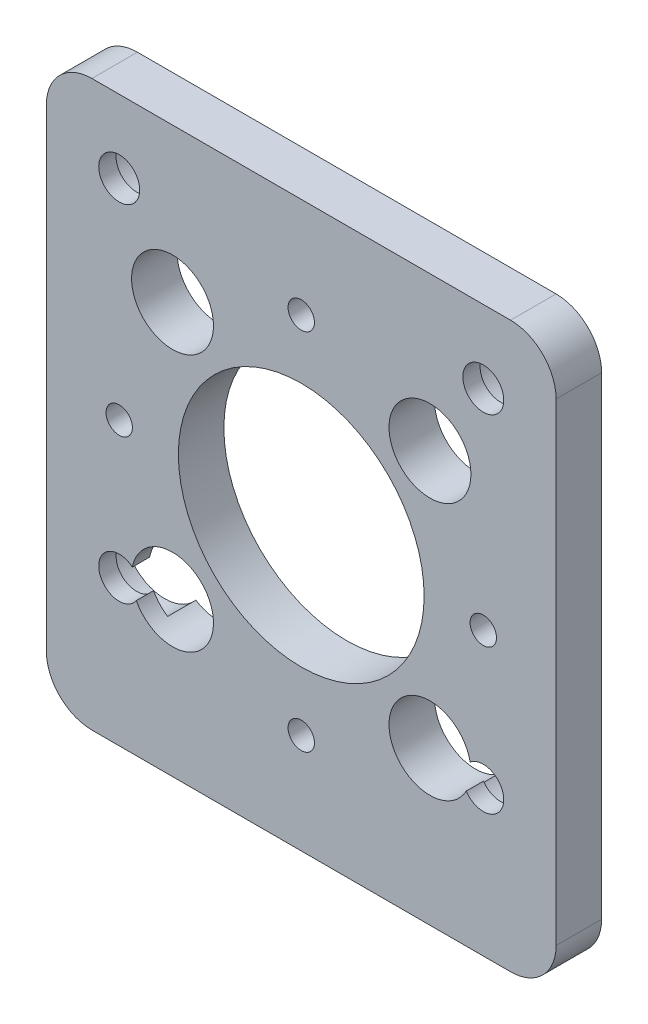
ISO-10303-21;
HEADER;
FILE_DESCRIPTION(('STEP AP214'),'2;1');
FILE_NAME('part.step','',(''),(''),'','','');
FILE_SCHEMA(('AUTOMOTIVE_DESIGN { 1 0 10303 214 1 1 1 1 }'));
ENDSEC;
DATA;
#1=APPLICATION_CONTEXT('core data for automotive mechanical design processes');
#2=APPLICATION_PROTOCOL_DEFINITION('international standard','automotive_design',2000,#1);
#3=PRODUCT_CONTEXT('',#1,'mechanical');
#4=PRODUCT('Part','Part','',(#3));
#5=PRODUCT_RELATED_PRODUCT_CATEGORY('part','',(#4));
#6=PRODUCT_DEFINITION_FORMATION('','',#4);
#7=PRODUCT_DEFINITION_CONTEXT('part definition',#1,'design');
#8=PRODUCT_DEFINITION('design','',#6,#7);
#9=PRODUCT_DEFINITION_SHAPE('','',#8);
#10=(LENGTH_UNIT() NAMED_UNIT(*) SI_UNIT(.MILLI.,.METRE.));
#11=(NAMED_UNIT(*) PLANE_ANGLE_UNIT() SI_UNIT($,.RADIAN.));
#12=(NAMED_UNIT(*) SI_UNIT($,.STERADIAN.) SOLID_ANGLE_UNIT());
#13=UNCERTAINTY_MEASURE_WITH_UNIT(LENGTH_MEASURE(1.E-05),#10,'distance_accuracy_value','');
#14=(GEOMETRIC_REPRESENTATION_CONTEXT(3) GLOBAL_UNCERTAINTY_ASSIGNED_CONTEXT((#13)) GLOBAL_UNIT_ASSIGNED_CONTEXT((#10,
#11,#12)) REPRESENTATION_CONTEXT('',''));
#15=CARTESIAN_POINT('',(0.,0.,0.));
#16=DIRECTION('',(0.,0.,1.));
#17=DIRECTION('',(1.,0.,0.));
#18=AXIS2_PLACEMENT_3D('',#15,#16,#17);
#19=CARTESIAN_POINT('',(0.,0.,5.));
#20=DIRECTION('',(0.,0.,-1.));
#21=DIRECTION('',(-1.,0.,0.));
#22=AXIS2_PLACEMENT_3D('',#19,#20,#21);
#23=PLANE('',#22);
#24=CARTESIAN_POINT('',(14.142135623731,14.1421356237309,5.));
#25=DIRECTION('',(0.,0.,1.));
#26=DIRECTION('',(1.,0.,0.));
#27=AXIS2_PLACEMENT_3D('',#24,#25,#26);
#28=CIRCLE('',#27,4.5);
#29=CARTESIAN_POINT('',(18.642135623731,14.1421356237309,5.));
#30=VERTEX_POINT('',#29);
#31=EDGE_CURVE('E439',#30,#30,#28,.T.);
#32=ORIENTED_EDGE('',*,*,#31,.F.);
#33=EDGE_LOOP('',(#32));
#34=FACE_BOUND('',#33,.T.);
#35=CARTESIAN_POINT('',(-14.1421356237309,14.142135623731,5.));
#36=DIRECTION('',(0.,0.,1.));
#37=DIRECTION('',(1.,0.,0.));
#38=AXIS2_PLACEMENT_3D('',#35,#36,#37);
#39=CIRCLE('',#38,4.5);
#40=CARTESIAN_POINT('',(-9.64213562373093,14.142135623731,5.));
#41=VERTEX_POINT('',#40);
#42=EDGE_CURVE('E169',#41,#41,#39,.T.);
#43=ORIENTED_EDGE('',*,*,#42,.F.);
#44=EDGE_LOOP('',(#43));
#45=FACE_BOUND('',#44,.T.);
#46=CARTESIAN_POINT('',(20.,23.,5.));
#47=DIRECTION('',(0.,0.,-1.));
#48=DIRECTION('',(-1.,0.,0.));
#49=AXIS2_PLACEMENT_3D('',#46,#47,#48);
#50=CIRCLE('',#49,2.25);
#51=CARTESIAN_POINT('',(17.75,23.,5.));
#52=VERTEX_POINT('',#51);
#53=EDGE_CURVE('E370',#52,#52,#50,.T.);
#54=ORIENTED_EDGE('',*,*,#53,.T.);
#55=EDGE_LOOP('',(#54));
#56=FACE_BOUND('',#55,.T.);
#57=CARTESIAN_POINT('',(-20.,23.,5.));
#58=DIRECTION('',(0.,0.,-1.));
#59=DIRECTION('',(-1.,0.,0.));
#60=AXIS2_PLACEMENT_3D('',#57,#58,#59);
#61=CIRCLE('',#60,2.25);
#62=CARTESIAN_POINT('',(-22.25,23.,5.));
#63=VERTEX_POINT('',#62);
#64=EDGE_CURVE('E386',#63,#63,#61,.T.);
#65=ORIENTED_EDGE('',*,*,#64,.T.);
#66=EDGE_LOOP('',(#65));
#67=FACE_BOUND('',#66,.T.);
#68=CARTESIAN_POINT('',(-20.,-15.,5.));
#69=DIRECTION('',(0.,0.,-1.));
#70=DIRECTION('',(-1.,0.,0.));
#71=AXIS2_PLACEMENT_3D('',#68,#69,#70);
#72=CIRCLE('',#71,2.25);
#73=CARTESIAN_POINT('',(-18.1229083262002,-16.2405752085833,5.));
#74=VERTEX_POINT('',#73);
#75=CARTESIAN_POINT('',(-18.5574592521436,-13.2732758787885,5.));
#76=VERTEX_POINT('',#75);
#77=EDGE_CURVE('E174',#74,#76,#72,.T.);
#78=ORIENTED_EDGE('',*,*,#77,.T.);
#79=CARTESIAN_POINT('',(-14.142135623731,-14.1421356237309,5.));
#80=DIRECTION('',(0.,0.,1.));
#81=DIRECTION('',(1.,0.,0.));
#82=AXIS2_PLACEMENT_3D('',#79,#80,#81);
#83=CIRCLE('',#82,4.5);
#84=EDGE_CURVE('E159',#74,#76,#83,.T.);
#85=ORIENTED_EDGE('',*,*,#84,.F.);
#86=EDGE_LOOP('',(#78,#85));
#87=FACE_BOUND('',#86,.T.);
#88=CARTESIAN_POINT('',(20.,-15.,5.));
#89=DIRECTION('',(0.,0.,-1.));
#90=DIRECTION('',(-1.,0.,0.));
#91=AXIS2_PLACEMENT_3D('',#88,#89,#90);
#92=CIRCLE('',#91,2.25);
#93=CARTESIAN_POINT('',(18.5574592521435,-13.2732758787885,5.));
#94=VERTEX_POINT('',#93);
#95=CARTESIAN_POINT('',(18.1229083262002,-16.2405752085833,5.));
#96=VERTEX_POINT('',#95);
#97=EDGE_CURVE('E200',#94,#96,#92,.T.);
#98=ORIENTED_EDGE('',*,*,#97,.T.);
#99=CARTESIAN_POINT('',(14.1421356237309,-14.142135623731,5.));
#100=DIRECTION('',(0.,0.,1.));
#101=DIRECTION('',(1.,0.,0.));
#102=AXIS2_PLACEMENT_3D('',#99,#100,#101);
#103=CIRCLE('',#102,4.5);
#104=EDGE_CURVE('E442',#94,#96,#103,.T.);
#105=ORIENTED_EDGE('',*,*,#104,.F.);
#106=EDGE_LOOP('',(#98,#105));
#107=FACE_BOUND('',#106,.T.);
#108=CARTESIAN_POINT('',(0.,20.,5.));
#109=DIRECTION('',(0.,0.,-1.));
#110=DIRECTION('',(-1.,0.,0.));
#111=AXIS2_PLACEMENT_3D('',#108,#109,#110);
#112=CIRCLE('',#111,1.45);
#113=CARTESIAN_POINT('',(-1.45,20.,5.));
#114=VERTEX_POINT('',#113);
#115=EDGE_CURVE('E208',#114,#114,#112,.T.);
#116=ORIENTED_EDGE('',*,*,#115,.T.);
#117=EDGE_LOOP('',(#116));
#118=FACE_BOUND('',#117,.T.);
#119=CARTESIAN_POINT('',(0.,-20.,5.));
#120=DIRECTION('',(0.,0.,-1.));
#121=DIRECTION('',(-1.,0.,0.));
#122=AXIS2_PLACEMENT_3D('',#119,#120,#121);
#123=CIRCLE('',#122,1.45);
#124=CARTESIAN_POINT('',(-1.45,-20.,5.));
#125=VERTEX_POINT('',#124);
#126=EDGE_CURVE('E216',#125,#125,#123,.T.);
#127=ORIENTED_EDGE('',*,*,#126,.T.);
#128=EDGE_LOOP('',(#127));
#129=FACE_BOUND('',#128,.T.);
#130=CARTESIAN_POINT('',(-20.,0.,5.));
#131=DIRECTION('',(0.,0.,-1.));
#132=DIRECTION('',(-1.,0.,0.));
#133=AXIS2_PLACEMENT_3D('',#130,#131,#132);
#134=CIRCLE('',#133,1.45);
#135=CARTESIAN_POINT('',(-21.45,0.,5.));
#136=VERTEX_POINT('',#135);
#137=EDGE_CURVE('E224',#136,#136,#134,.T.);
#138=ORIENTED_EDGE('',*,*,#137,.T.);
#139=EDGE_LOOP('',(#138));
#140=FACE_BOUND('',#139,.T.);
#141=CARTESIAN_POINT('',(20.,0.,5.));
#142=DIRECTION('',(0.,0.,-1.));
#143=DIRECTION('',(-1.,0.,0.));
#144=AXIS2_PLACEMENT_3D('',#141,#142,#143);
#145=CIRCLE('',#144,1.45);
#146=CARTESIAN_POINT('',(18.55,0.,5.));
#147=VERTEX_POINT('',#146);
#148=EDGE_CURVE('E232',#147,#147,#145,.T.);
#149=ORIENTED_EDGE('',*,*,#148,.T.);
#150=EDGE_LOOP('',(#149));
#151=FACE_BOUND('',#150,.T.);
#152=DIRECTION('',(1.,0.,0.));
#153=VECTOR('',#152,1.);
#154=CARTESIAN_POINT('',(-28.,-31.,5.));
#155=LINE('',#154,#153);
#156=CARTESIAN_POINT('',(-23.,-31.,5.));
#157=VERTEX_POINT('',#156);
#158=CARTESIAN_POINT('',(23.,-31.,5.));
#159=VERTEX_POINT('',#158);
#160=EDGE_CURVE('E258',#157,#159,#155,.T.);
#161=ORIENTED_EDGE('',*,*,#160,.T.);
#162=CARTESIAN_POINT('',(23.,-26.,5.));
#163=DIRECTION('',(0.,0.,-1.));
#164=DIRECTION('',(-1.,0.,0.));
#165=AXIS2_PLACEMENT_3D('',#162,#163,#164);
#166=CIRCLE('',#165,5.);
#167=CARTESIAN_POINT('',(28.,-26.,5.));
#168=VERTEX_POINT('',#167);
#169=EDGE_CURVE('E311',#159,#168,#166,.F.);
#170=ORIENTED_EDGE('',*,*,#169,.T.);
#171=DIRECTION('',(0.,1.,0.));
#172=VECTOR('',#171,1.);
#173=CARTESIAN_POINT('',(28.,-31.,5.));
#174=LINE('',#173,#172);
#175=CARTESIAN_POINT('',(28.,26.,5.));
#176=VERTEX_POINT('',#175);
#177=EDGE_CURVE('E245',#168,#176,#174,.T.);
#178=ORIENTED_EDGE('',*,*,#177,.T.);
#179=CARTESIAN_POINT('',(23.,26.,5.));
#180=DIRECTION('',(0.,0.,-1.));
#181=DIRECTION('',(-1.,0.,0.));
#182=AXIS2_PLACEMENT_3D('',#179,#180,#181);
#183=CIRCLE('',#182,5.);
#184=CARTESIAN_POINT('',(23.,31.,5.));
#185=VERTEX_POINT('',#184);
#186=EDGE_CURVE('E302',#176,#185,#183,.F.);
#187=ORIENTED_EDGE('',*,*,#186,.T.);
#188=DIRECTION('',(-1.,0.,0.));
#189=VECTOR('',#188,1.);
#190=CARTESIAN_POINT('',(-28.,31.,5.));
#191=LINE('',#190,#189);
#192=CARTESIAN_POINT('',(-23.,31.,5.));
#193=VERTEX_POINT('',#192);
#194=EDGE_CURVE('E249',#185,#193,#191,.T.);
#195=ORIENTED_EDGE('',*,*,#194,.T.);
#196=CARTESIAN_POINT('',(-23.,26.,5.));
#197=DIRECTION('',(0.,0.,-1.));
#198=DIRECTION('',(-1.,0.,0.));
#199=AXIS2_PLACEMENT_3D('',#196,#197,#198);
#200=CIRCLE('',#199,5.);
#201=CARTESIAN_POINT('',(-28.,26.,5.));
#202=VERTEX_POINT('',#201);
#203=EDGE_CURVE('E305',#193,#202,#200,.F.);
#204=ORIENTED_EDGE('',*,*,#203,.T.);
#205=DIRECTION('',(0.,-1.,0.));
#206=VECTOR('',#205,1.);
#207=CARTESIAN_POINT('',(-28.,-31.,5.));
#208=LINE('',#207,#206);
#209=CARTESIAN_POINT('',(-28.,-26.,5.));
#210=VERTEX_POINT('',#209);
#211=EDGE_CURVE('E254',#202,#210,#208,.T.);
#212=ORIENTED_EDGE('',*,*,#211,.T.);
#213=CARTESIAN_POINT('',(-23.,-26.,5.));
#214=DIRECTION('',(0.,0.,-1.));
#215=DIRECTION('',(-1.,0.,0.));
#216=AXIS2_PLACEMENT_3D('',#213,#214,#215);
#217=CIRCLE('',#216,5.);
#218=EDGE_CURVE('E308',#210,#157,#217,.F.);
#219=ORIENTED_EDGE('',*,*,#218,.T.);
#220=EDGE_LOOP('',(#161,#170,#178,#187,#195,#204,#212,#219));
#221=FACE_BOUND('',#220,.T.);
#222=CARTESIAN_POINT('',(0.,0.,5.));
#223=DIRECTION('',(0.,0.,1.));
#224=DIRECTION('',(1.,0.,0.));
#225=AXIS2_PLACEMENT_3D('',#222,#223,#224);
#226=CIRCLE('',#225,13.5);
#227=CARTESIAN_POINT('',(13.5,0.,5.));
#228=VERTEX_POINT('',#227);
#229=EDGE_CURVE('E237',#228,#228,#226,.T.);
#230=ORIENTED_EDGE('',*,*,#229,.F.);
#231=EDGE_LOOP('',(#230));
#232=FACE_BOUND('',#231,.T.);
#233=ADVANCED_FACE('F45',(#34,#45,#56,#67,#87,#107,#118,#129,#140,#151,#221,#232),#23,.F.);
#234=CARTESIAN_POINT('',(0.,0.,0.));
#235=DIRECTION('',(0.,0.,-1.));
#236=DIRECTION('',(-1.,0.,0.));
#237=AXIS2_PLACEMENT_3D('',#234,#235,#236);
#238=PLANE('',#237);
#239=CARTESIAN_POINT('',(14.1421356237309,-14.142135623731,0.));
#240=DIRECTION('',(0.,0.,-1.));
#241=DIRECTION('',(-1.,0.,0.));
#242=AXIS2_PLACEMENT_3D('',#239,#240,#241);
#243=CIRCLE('',#242,4.5);
#244=CARTESIAN_POINT('',(16.5799543316291,-17.9246004216401,0.));
#245=VERTEX_POINT('',#244);
#246=CARTESIAN_POINT('',(17.5621812921018,-11.2175352020909,0.));
#247=VERTEX_POINT('',#246);
#248=EDGE_CURVE('E354',#245,#247,#243,.T.);
#249=ORIENTED_EDGE('',*,*,#248,.F.);
#250=CARTESIAN_POINT('',(20.,-15.,0.));
#251=DIRECTION('',(0.,0.,-1.));
#252=DIRECTION('',(-1.,0.,0.));
#253=AXIS2_PLACEMENT_3D('',#250,#251,#252);
#254=CIRCLE('',#253,4.5);
#255=EDGE_CURVE('E182',#247,#245,#254,.T.);
#256=ORIENTED_EDGE('',*,*,#255,.F.);
#257=EDGE_LOOP('',(#249,#256));
#258=FACE_BOUND('',#257,.T.);
#259=CARTESIAN_POINT('',(14.142135623731,14.1421356237309,0.));
#260=DIRECTION('',(0.,0.,-1.));
#261=DIRECTION('',(-1.,0.,0.));
#262=AXIS2_PLACEMENT_3D('',#259,#260,#261);
#263=CIRCLE('',#262,4.5);
#264=CARTESIAN_POINT('',(9.64213562373097,14.1421356237309,0.));
#265=VERTEX_POINT('',#264);
#266=EDGE_CURVE('E49',#265,#265,#263,.T.);
#267=ORIENTED_EDGE('',*,*,#266,.F.);
#268=EDGE_LOOP('',(#267));
#269=FACE_BOUND('',#268,.T.);
#270=CARTESIAN_POINT('',(-14.1421356237309,14.142135623731,0.));
#271=DIRECTION('',(0.,0.,-1.));
#272=DIRECTION('',(-1.,0.,0.));
#273=AXIS2_PLACEMENT_3D('',#270,#271,#272);
#274=CIRCLE('',#273,4.5);
#275=CARTESIAN_POINT('',(-18.6421356237309,14.142135623731,0.));
#276=VERTEX_POINT('',#275);
#277=EDGE_CURVE('E336',#276,#276,#274,.T.);
#278=ORIENTED_EDGE('',*,*,#277,.F.);
#279=EDGE_LOOP('',(#278));
#280=FACE_BOUND('',#279,.T.);
#281=CARTESIAN_POINT('',(-14.142135623731,-14.1421356237309,0.));
#282=DIRECTION('',(0.,0.,-1.));
#283=DIRECTION('',(-1.,0.,0.));
#284=AXIS2_PLACEMENT_3D('',#281,#282,#283);
#285=CIRCLE('',#284,4.5);
#286=CARTESIAN_POINT('',(-17.5621812921019,-11.2175352020908,0.));
#287=VERTEX_POINT('',#286);
#288=CARTESIAN_POINT('',(-16.5799543316291,-17.9246004216401,0.));
#289=VERTEX_POINT('',#288);
#290=EDGE_CURVE('E178',#287,#289,#285,.T.);
#291=ORIENTED_EDGE('',*,*,#290,.F.);
#292=CARTESIAN_POINT('',(-20.,-15.,0.));
#293=DIRECTION('',(0.,0.,-1.));
#294=DIRECTION('',(-1.,0.,0.));
#295=AXIS2_PLACEMENT_3D('',#292,#293,#294);
#296=CIRCLE('',#295,4.5);
#297=EDGE_CURVE('E390',#289,#287,#296,.T.);
#298=ORIENTED_EDGE('',*,*,#297,.F.);
#299=EDGE_LOOP('',(#291,#298));
#300=FACE_BOUND('',#299,.T.);
#301=CARTESIAN_POINT('',(20.,23.,0.));
#302=DIRECTION('',(0.,0.,-1.));
#303=DIRECTION('',(-1.,0.,0.));
#304=AXIS2_PLACEMENT_3D('',#301,#302,#303);
#305=CIRCLE('',#304,4.5);
#306=CARTESIAN_POINT('',(15.5,23.,0.));
#307=VERTEX_POINT('',#306);
#308=EDGE_CURVE('E345',#307,#307,#305,.T.);
#309=ORIENTED_EDGE('',*,*,#308,.F.);
#310=EDGE_LOOP('',(#309));
#311=FACE_BOUND('',#310,.T.);
#312=CARTESIAN_POINT('',(-20.,23.,0.));
#313=DIRECTION('',(0.,0.,-1.));
#314=DIRECTION('',(-1.,0.,0.));
#315=AXIS2_PLACEMENT_3D('',#312,#313,#314);
#316=CIRCLE('',#315,4.5);
#317=CARTESIAN_POINT('',(-24.5,23.,0.));
#318=VERTEX_POINT('',#317);
#319=EDGE_CURVE('E374',#318,#318,#316,.T.);
#320=ORIENTED_EDGE('',*,*,#319,.F.);
#321=EDGE_LOOP('',(#320));
#322=FACE_BOUND('',#321,.T.);
#323=CARTESIAN_POINT('',(0.,20.,0.));
#324=DIRECTION('',(0.,0.,-1.));
#325=DIRECTION('',(-1.,0.,0.));
#326=AXIS2_PLACEMENT_3D('',#323,#324,#325);
#327=CIRCLE('',#326,1.44999999999999);
#328=CARTESIAN_POINT('',(-1.44999999999999,20.,0.));
#329=VERTEX_POINT('',#328);
#330=EDGE_CURVE('E204',#329,#329,#327,.T.);
#331=ORIENTED_EDGE('',*,*,#330,.F.);
#332=EDGE_LOOP('',(#331));
#333=FACE_BOUND('',#332,.T.);
#334=CARTESIAN_POINT('',(0.,-20.,0.));
#335=DIRECTION('',(0.,0.,-1.));
#336=DIRECTION('',(-1.,0.,0.));
#337=AXIS2_PLACEMENT_3D('',#334,#335,#336);
#338=CIRCLE('',#337,1.44999999999999);
#339=CARTESIAN_POINT('',(-1.44999999999999,-20.,0.));
#340=VERTEX_POINT('',#339);
#341=EDGE_CURVE('E212',#340,#340,#338,.T.);
#342=ORIENTED_EDGE('',*,*,#341,.F.);
#343=EDGE_LOOP('',(#342));
#344=FACE_BOUND('',#343,.T.);
#345=CARTESIAN_POINT('',(-20.,0.,0.));
#346=DIRECTION('',(0.,0.,-1.));
#347=DIRECTION('',(-1.,0.,0.));
#348=AXIS2_PLACEMENT_3D('',#345,#346,#347);
#349=CIRCLE('',#348,1.44999999999999);
#350=CARTESIAN_POINT('',(-21.45,0.,0.));
#351=VERTEX_POINT('',#350);
#352=EDGE_CURVE('E220',#351,#351,#349,.T.);
#353=ORIENTED_EDGE('',*,*,#352,.F.);
#354=EDGE_LOOP('',(#353));
#355=FACE_BOUND('',#354,.T.);
#356=CARTESIAN_POINT('',(20.,0.,0.));
#357=DIRECTION('',(0.,0.,-1.));
#358=DIRECTION('',(-1.,0.,0.));
#359=AXIS2_PLACEMENT_3D('',#356,#357,#358);
#360=CIRCLE('',#359,1.44999999999999);
#361=CARTESIAN_POINT('',(18.55,0.,0.));
#362=VERTEX_POINT('',#361);
#363=EDGE_CURVE('E228',#362,#362,#360,.T.);
#364=ORIENTED_EDGE('',*,*,#363,.F.);
#365=EDGE_LOOP('',(#364));
#366=FACE_BOUND('',#365,.T.);
#367=DIRECTION('',(0.,1.,0.));
#368=VECTOR('',#367,1.);
#369=CARTESIAN_POINT('',(28.,-31.,0.));
#370=LINE('',#369,#368);
#371=CARTESIAN_POINT('',(28.,-26.,0.));
#372=VERTEX_POINT('',#371);
#373=CARTESIAN_POINT('',(28.,26.,0.));
#374=VERTEX_POINT('',#373);
#375=EDGE_CURVE('E241',#372,#374,#370,.T.);
#376=ORIENTED_EDGE('',*,*,#375,.F.);
#377=CARTESIAN_POINT('',(23.,-26.,0.));
#378=DIRECTION('',(0.,0.,-1.));
#379=DIRECTION('',(-1.,0.,0.));
#380=AXIS2_PLACEMENT_3D('',#377,#378,#379);
#381=CIRCLE('',#380,5.);
#382=CARTESIAN_POINT('',(23.,-31.,0.));
#383=VERTEX_POINT('',#382);
#384=EDGE_CURVE('E292',#372,#383,#381,.T.);
#385=ORIENTED_EDGE('',*,*,#384,.T.);
#386=DIRECTION('',(1.,0.,0.));
#387=VECTOR('',#386,1.);
#388=CARTESIAN_POINT('',(-28.,-31.,0.));
#389=LINE('',#388,#387);
#390=CARTESIAN_POINT('',(-23.,-31.,0.));
#391=VERTEX_POINT('',#390);
#392=EDGE_CURVE('E250',#391,#383,#389,.T.);
#393=ORIENTED_EDGE('',*,*,#392,.F.);
#394=CARTESIAN_POINT('',(-23.,-26.,0.));
#395=DIRECTION('',(0.,0.,-1.));
#396=DIRECTION('',(-1.,0.,0.));
#397=AXIS2_PLACEMENT_3D('',#394,#395,#396);
#398=CIRCLE('',#397,5.);
#399=CARTESIAN_POINT('',(-28.,-26.,0.));
#400=VERTEX_POINT('',#399);
#401=EDGE_CURVE('E289',#391,#400,#398,.T.);
#402=ORIENTED_EDGE('',*,*,#401,.T.);
#403=DIRECTION('',(0.,-1.,0.));
#404=VECTOR('',#403,1.);
#405=CARTESIAN_POINT('',(-28.,-31.,0.));
#406=LINE('',#405,#404);
#407=CARTESIAN_POINT('',(-28.,26.,0.));
#408=VERTEX_POINT('',#407);
#409=EDGE_CURVE('E270',#408,#400,#406,.T.);
#410=ORIENTED_EDGE('',*,*,#409,.F.);
#411=CARTESIAN_POINT('',(-23.,26.,0.));
#412=DIRECTION('',(0.,0.,-1.));
#413=DIRECTION('',(-1.,0.,0.));
#414=AXIS2_PLACEMENT_3D('',#411,#412,#413);
#415=CIRCLE('',#414,5.);
#416=CARTESIAN_POINT('',(-23.,31.,0.));
#417=VERTEX_POINT('',#416);
#418=EDGE_CURVE('E286',#408,#417,#415,.T.);
#419=ORIENTED_EDGE('',*,*,#418,.T.);
#420=DIRECTION('',(-1.,0.,0.));
#421=VECTOR('',#420,1.);
#422=CARTESIAN_POINT('',(-28.,31.,0.));
#423=LINE('',#422,#421);
#424=CARTESIAN_POINT('',(23.,31.,0.));
#425=VERTEX_POINT('',#424);
#426=EDGE_CURVE('E266',#425,#417,#423,.T.);
#427=ORIENTED_EDGE('',*,*,#426,.F.);
#428=CARTESIAN_POINT('',(23.,26.,0.));
#429=DIRECTION('',(0.,0.,-1.));
#430=DIRECTION('',(-1.,0.,0.));
#431=AXIS2_PLACEMENT_3D('',#428,#429,#430);
#432=CIRCLE('',#431,5.);
#433=EDGE_CURVE('E283',#425,#374,#432,.T.);
#434=ORIENTED_EDGE('',*,*,#433,.T.);
#435=EDGE_LOOP('',(#376,#385,#393,#402,#410,#419,#427,#434));
#436=FACE_BOUND('',#435,.T.);
#437=CARTESIAN_POINT('',(0.,0.,0.));
#438=DIRECTION('',(0.,0.,1.));
#439=DIRECTION('',(1.,0.,0.));
#440=AXIS2_PLACEMENT_3D('',#437,#438,#439);
#441=CIRCLE('',#440,13.5);
#442=CARTESIAN_POINT('',(13.5,0.,0.));
#443=VERTEX_POINT('',#442);
#444=EDGE_CURVE('E236',#443,#443,#441,.T.);
#445=ORIENTED_EDGE('',*,*,#444,.T.);
#446=EDGE_LOOP('',(#445));
#447=FACE_BOUND('',#446,.T.);
#448=ADVANCED_FACE('F405',(#258,#269,#280,#300,#311,#322,#333,#344,#355,#366,#436,#447),#238,.T.);
#449=CARTESIAN_POINT('',(28.,-31.,5.));
#450=DIRECTION('',(-1.,0.,0.));
#451=DIRECTION('',(0.,0.,1.));
#452=AXIS2_PLACEMENT_3D('',#449,#450,#451);
#453=PLANE('',#452);
#454=ORIENTED_EDGE('',*,*,#177,.F.);
#455=DIRECTION('',(0.,0.,-1.));
#456=VECTOR('',#455,1.);
#457=CARTESIAN_POINT('',(28.,-26.,5.));
#458=LINE('',#457,#456);
#459=EDGE_CURVE('E279',#168,#372,#458,.T.);
#460=ORIENTED_EDGE('',*,*,#459,.T.);
#461=ORIENTED_EDGE('',*,*,#375,.T.);
#462=DIRECTION('',(0.,0.,-1.));
#463=VECTOR('',#462,1.);
#464=CARTESIAN_POINT('',(28.,26.,5.));
#465=LINE('',#464,#463);
#466=EDGE_CURVE('E262',#374,#176,#465,.F.);
#467=ORIENTED_EDGE('',*,*,#466,.T.);
#468=EDGE_LOOP('',(#454,#460,#461,#467));
#469=FACE_BOUND('',#468,.T.);
#470=ADVANCED_FACE('F427',(#469),#453,.F.);
#471=CARTESIAN_POINT('',(-28.,31.,5.));
#472=DIRECTION('',(0.,-1.,0.));
#473=DIRECTION('',(0.,0.,-1.));
#474=AXIS2_PLACEMENT_3D('',#471,#472,#473);
#475=PLANE('',#474);
#476=ORIENTED_EDGE('',*,*,#426,.T.);
#477=DIRECTION('',(0.,0.,-1.));
#478=VECTOR('',#477,1.);
#479=CARTESIAN_POINT('',(-23.,31.,5.));
#480=LINE('',#479,#478);
#481=EDGE_CURVE('E325',#417,#193,#480,.F.);
#482=ORIENTED_EDGE('',*,*,#481,.T.);
#483=ORIENTED_EDGE('',*,*,#194,.F.);
#484=DIRECTION('',(0.,0.,-1.));
#485=VECTOR('',#484,1.);
#486=CARTESIAN_POINT('',(23.,31.,5.));
#487=LINE('',#486,#485);
#488=EDGE_CURVE('E321',#185,#425,#487,.T.);
#489=ORIENTED_EDGE('',*,*,#488,.T.);
#490=EDGE_LOOP('',(#476,#482,#483,#489));
#491=FACE_BOUND('',#490,.T.);
#492=ADVANCED_FACE('F483',(#491),#475,.F.);
#493=CARTESIAN_POINT('',(-28.,-31.,5.));
#494=DIRECTION('',(1.,0.,0.));
#495=DIRECTION('',(0.,1.,0.));
#496=AXIS2_PLACEMENT_3D('',#493,#494,#495);
#497=PLANE('',#496);
#498=ORIENTED_EDGE('',*,*,#409,.T.);
#499=DIRECTION('',(0.,0.,-1.));
#500=VECTOR('',#499,1.);
#501=CARTESIAN_POINT('',(-28.,-26.,5.));
#502=LINE('',#501,#500);
#503=EDGE_CURVE('E318',#400,#210,#502,.F.);
#504=ORIENTED_EDGE('',*,*,#503,.T.);
#505=ORIENTED_EDGE('',*,*,#211,.F.);
#506=DIRECTION('',(0.,0.,-1.));
#507=VECTOR('',#506,1.);
#508=CARTESIAN_POINT('',(-28.,26.,5.));
#509=LINE('',#508,#507);
#510=EDGE_CURVE('E314',#202,#408,#509,.T.);
#511=ORIENTED_EDGE('',*,*,#510,.T.);
#512=EDGE_LOOP('',(#498,#504,#505,#511));
#513=FACE_BOUND('',#512,.T.);
#514=ADVANCED_FACE('F479',(#513),#497,.F.);
#515=CARTESIAN_POINT('',(-28.,-31.,5.));
#516=DIRECTION('',(0.,1.,0.));
#517=DIRECTION('',(-1.,0.,0.));
#518=AXIS2_PLACEMENT_3D('',#515,#516,#517);
#519=PLANE('',#518);
#520=ORIENTED_EDGE('',*,*,#392,.T.);
#521=DIRECTION('',(0.,0.,-1.));
#522=VECTOR('',#521,1.);
#523=CARTESIAN_POINT('',(23.,-31.,5.));
#524=LINE('',#523,#522);
#525=EDGE_CURVE('E299',#383,#159,#524,.F.);
#526=ORIENTED_EDGE('',*,*,#525,.T.);
#527=ORIENTED_EDGE('',*,*,#160,.F.);
#528=DIRECTION('',(0.,0.,-1.));
#529=VECTOR('',#528,1.);
#530=CARTESIAN_POINT('',(-23.,-31.,5.));
#531=LINE('',#530,#529);
#532=EDGE_CURVE('E295',#157,#391,#531,.T.);
#533=ORIENTED_EDGE('',*,*,#532,.T.);
#534=EDGE_LOOP('',(#520,#526,#527,#533));
#535=FACE_BOUND('',#534,.T.);
#536=ADVANCED_FACE('F476',(#535),#519,.F.);
#537=CARTESIAN_POINT('',(0.,0.,5.));
#538=DIRECTION('',(0.,0.,-1.));
#539=DIRECTION('',(-1.,0.,0.));
#540=AXIS2_PLACEMENT_3D('',#537,#538,#539);
#541=CYLINDRICAL_SURFACE('',#540,13.5);
#542=ORIENTED_EDGE('',*,*,#229,.T.);
#543=EDGE_LOOP('',(#542));
#544=FACE_BOUND('',#543,.T.);
#545=ORIENTED_EDGE('',*,*,#444,.F.);
#546=EDGE_LOOP('',(#545));
#547=FACE_BOUND('',#546,.T.);
#548=ADVANCED_FACE('F473',(#544,#547),#541,.F.);
#549=CARTESIAN_POINT('',(20.,0.,0.));
#550=DIRECTION('',(0.,0.,-1.));
#551=DIRECTION('',(-1.,0.,0.));
#552=AXIS2_PLACEMENT_3D('',#549,#550,#551);
#553=CYLINDRICAL_SURFACE('',#552,1.44999999999999);
#554=ORIENTED_EDGE('',*,*,#148,.F.);
#555=EDGE_LOOP('',(#554));
#556=FACE_BOUND('',#555,.T.);
#557=ORIENTED_EDGE('',*,*,#363,.T.);
#558=EDGE_LOOP('',(#557));
#559=FACE_BOUND('',#558,.T.);
#560=ADVANCED_FACE('F532',(#556,#559),#553,.F.);
#561=CARTESIAN_POINT('',(-20.,0.,0.));
#562=DIRECTION('',(0.,0.,-1.));
#563=DIRECTION('',(-1.,0.,0.));
#564=AXIS2_PLACEMENT_3D('',#561,#562,#563);
#565=CYLINDRICAL_SURFACE('',#564,1.44999999999999);
#566=ORIENTED_EDGE('',*,*,#137,.F.);
#567=EDGE_LOOP('',(#566));
#568=FACE_BOUND('',#567,.T.);
#569=ORIENTED_EDGE('',*,*,#352,.T.);
#570=EDGE_LOOP('',(#569));
#571=FACE_BOUND('',#570,.T.);
#572=ADVANCED_FACE('F537',(#568,#571),#565,.F.);
#573=CARTESIAN_POINT('',(0.,-20.,0.));
#574=DIRECTION('',(0.,0.,-1.));
#575=DIRECTION('',(-1.,0.,0.));
#576=AXIS2_PLACEMENT_3D('',#573,#574,#575);
#577=CYLINDRICAL_SURFACE('',#576,1.44999999999999);
#578=ORIENTED_EDGE('',*,*,#126,.F.);
#579=EDGE_LOOP('',(#578));
#580=FACE_BOUND('',#579,.T.);
#581=ORIENTED_EDGE('',*,*,#341,.T.);
#582=EDGE_LOOP('',(#581));
#583=FACE_BOUND('',#582,.T.);
#584=ADVANCED_FACE('F463',(#580,#583),#577,.F.);
#585=CARTESIAN_POINT('',(0.,20.,0.));
#586=DIRECTION('',(0.,0.,-1.));
#587=DIRECTION('',(-1.,0.,0.));
#588=AXIS2_PLACEMENT_3D('',#585,#586,#587);
#589=CYLINDRICAL_SURFACE('',#588,1.44999999999999);
#590=ORIENTED_EDGE('',*,*,#115,.F.);
#591=EDGE_LOOP('',(#590));
#592=FACE_BOUND('',#591,.T.);
#593=ORIENTED_EDGE('',*,*,#330,.T.);
#594=EDGE_LOOP('',(#593));
#595=FACE_BOUND('',#594,.T.);
#596=ADVANCED_FACE('F455',(#592,#595),#589,.F.);
#597=CARTESIAN_POINT('',(20.,-15.,0.));
#598=DIRECTION('',(0.,0.,-1.));
#599=DIRECTION('',(-1.,0.,0.));
#600=AXIS2_PLACEMENT_3D('',#597,#598,#599);
#601=CYLINDRICAL_SURFACE('',#600,2.25);
#602=ORIENTED_EDGE('',*,*,#97,.F.);
#603=DIRECTION('',(0.,0.,1.));
#604=VECTOR('',#603,1.);
#605=CARTESIAN_POINT('',(18.5574592521435,-13.2732758787885,2.499994));
#606=LINE('',#605,#604);
#607=CARTESIAN_POINT('',(18.5574592521435,-13.2732758787885,3.1));
#608=VERTEX_POINT('',#607);
#609=EDGE_CURVE('E339',#94,#608,#606,.F.);
#610=ORIENTED_EDGE('',*,*,#609,.T.);
#611=CARTESIAN_POINT('',(20.,-15.,3.1));
#612=DIRECTION('',(0.,0.,-1.));
#613=DIRECTION('',(-1.,0.,0.));
#614=AXIS2_PLACEMENT_3D('',#611,#612,#613);
#615=CIRCLE('',#614,2.25);
#616=CARTESIAN_POINT('',(18.1229083262002,-16.2405752085833,3.1));
#617=VERTEX_POINT('',#616);
#618=EDGE_CURVE('E196',#608,#617,#615,.T.);
#619=ORIENTED_EDGE('',*,*,#618,.T.);
#620=DIRECTION('',(0.,0.,1.));
#621=VECTOR('',#620,1.);
#622=CARTESIAN_POINT('',(18.1229083262002,-16.2405752085833,2.499994));
#623=LINE('',#622,#621);
#624=EDGE_CURVE('E414',#617,#96,#623,.T.);
#625=ORIENTED_EDGE('',*,*,#624,.T.);
#626=EDGE_LOOP('',(#602,#610,#619,#625));
#627=FACE_BOUND('',#626,.T.);
#628=ADVANCED_FACE('F452',(#627),#601,.F.);
#629=CARTESIAN_POINT('',(22.25,-15.,3.1));
#630=DIRECTION('',(0.,0.,1.));
#631=DIRECTION('',(1.,0.,0.));
#632=AXIS2_PLACEMENT_3D('',#629,#630,#631);
#633=PLANE('',#632);
#634=ORIENTED_EDGE('',*,*,#618,.F.);
#635=CARTESIAN_POINT('',(14.1421356237309,-14.142135623731,3.1));
#636=DIRECTION('',(0.,0.,1.));
#637=DIRECTION('',(1.,0.,0.));
#638=AXIS2_PLACEMENT_3D('',#635,#636,#637);
#639=CIRCLE('',#638,4.5);
#640=CARTESIAN_POINT('',(17.5621812921018,-11.2175352020909,3.1));
#641=VERTEX_POINT('',#640);
#642=EDGE_CURVE('E347',#608,#641,#639,.T.);
#643=ORIENTED_EDGE('',*,*,#642,.T.);
#644=CARTESIAN_POINT('',(20.,-15.,3.1));
#645=DIRECTION('',(0.,0.,-1.));
#646=DIRECTION('',(-1.,0.,0.));
#647=AXIS2_PLACEMENT_3D('',#644,#645,#646);
#648=CIRCLE('',#647,4.5);
#649=CARTESIAN_POINT('',(16.5799543316291,-17.9246004216401,3.1));
#650=VERTEX_POINT('',#649);
#651=EDGE_CURVE('E187',#641,#650,#648,.T.);
#652=ORIENTED_EDGE('',*,*,#651,.T.);
#653=EDGE_CURVE('E63',#650,#617,#639,.T.);
#654=ORIENTED_EDGE('',*,*,#653,.T.);
#655=EDGE_LOOP('',(#634,#643,#652,#654));
#656=FACE_BOUND('',#655,.T.);
#657=ADVANCED_FACE('F454',(#656),#633,.F.);
#658=CARTESIAN_POINT('',(20.,-15.,0.));
#659=DIRECTION('',(0.,0.,-1.));
#660=DIRECTION('',(-1.,0.,0.));
#661=AXIS2_PLACEMENT_3D('',#658,#659,#660);
#662=CYLINDRICAL_SURFACE('',#661,4.5);
#663=ORIENTED_EDGE('',*,*,#651,.F.);
#664=DIRECTION('',(0.,0.,1.));
#665=VECTOR('',#664,1.);
#666=CARTESIAN_POINT('',(17.5621812921018,-11.2175352020909,2.499994));
#667=LINE('',#666,#665);
#668=EDGE_CURVE('E11',#641,#247,#667,.F.);
#669=ORIENTED_EDGE('',*,*,#668,.T.);
#670=ORIENTED_EDGE('',*,*,#255,.T.);
#671=DIRECTION('',(0.,0.,1.));
#672=VECTOR('',#671,1.);
#673=CARTESIAN_POINT('',(16.5799543316291,-17.9246004216401,2.499994));
#674=LINE('',#673,#672);
#675=EDGE_CURVE('E55',#245,#650,#674,.T.);
#676=ORIENTED_EDGE('',*,*,#675,.T.);
#677=EDGE_LOOP('',(#663,#669,#670,#676));
#678=FACE_BOUND('',#677,.T.);
#679=ADVANCED_FACE('F424',(#678),#662,.F.);
#680=CARTESIAN_POINT('',(-20.,-15.,0.));
#681=DIRECTION('',(0.,0.,-1.));
#682=DIRECTION('',(-1.,0.,0.));
#683=AXIS2_PLACEMENT_3D('',#680,#681,#682);
#684=CYLINDRICAL_SURFACE('',#683,2.25);
#685=ORIENTED_EDGE('',*,*,#77,.F.);
#686=DIRECTION('',(0.,0.,1.));
#687=VECTOR('',#686,1.);
#688=CARTESIAN_POINT('',(-18.1229083262002,-16.2405752085833,2.499994));
#689=LINE('',#688,#687);
#690=CARTESIAN_POINT('',(-18.1229083262002,-16.2405752085833,3.1));
#691=VERTEX_POINT('',#690);
#692=EDGE_CURVE('E164',#74,#691,#689,.F.);
#693=ORIENTED_EDGE('',*,*,#692,.T.);
#694=CARTESIAN_POINT('',(-20.,-15.,3.1));
#695=DIRECTION('',(0.,0.,-1.));
#696=DIRECTION('',(-1.,0.,0.));
#697=AXIS2_PLACEMENT_3D('',#694,#695,#696);
#698=CIRCLE('',#697,2.25);
#699=CARTESIAN_POINT('',(-18.5574592521436,-13.2732758787885,3.1));
#700=VERTEX_POINT('',#699);
#701=EDGE_CURVE('E176',#691,#700,#698,.T.);
#702=ORIENTED_EDGE('',*,*,#701,.T.);
#703=DIRECTION('',(0.,0.,1.));
#704=VECTOR('',#703,1.);
#705=CARTESIAN_POINT('',(-18.5574592521436,-13.2732758787885,2.499994));
#706=LINE('',#705,#704);
#707=EDGE_CURVE('E162',#700,#76,#706,.T.);
#708=ORIENTED_EDGE('',*,*,#707,.T.);
#709=EDGE_LOOP('',(#685,#693,#702,#708));
#710=FACE_BOUND('',#709,.T.);
#711=ADVANCED_FACE('F173',(#710),#684,.F.);
#712=CARTESIAN_POINT('',(-17.75,-15.,3.1));
#713=DIRECTION('',(0.,0.,1.));
#714=DIRECTION('',(1.,0.,0.));
#715=AXIS2_PLACEMENT_3D('',#712,#713,#714);
#716=PLANE('',#715);
#717=CARTESIAN_POINT('',(-20.,-15.,3.1));
#718=DIRECTION('',(0.,0.,-1.));
#719=DIRECTION('',(-1.,0.,0.));
#720=AXIS2_PLACEMENT_3D('',#717,#718,#719);
#721=CIRCLE('',#720,4.5);
#722=CARTESIAN_POINT('',(-16.5799543316291,-17.9246004216401,3.1));
#723=VERTEX_POINT('',#722);
#724=CARTESIAN_POINT('',(-17.5621812921019,-11.2175352020908,3.1));
#725=VERTEX_POINT('',#724);
#726=EDGE_CURVE('E189',#723,#725,#721,.T.);
#727=ORIENTED_EDGE('',*,*,#726,.T.);
#728=CARTESIAN_POINT('',(-14.142135623731,-14.1421356237309,3.1));
#729=DIRECTION('',(0.,0.,1.));
#730=DIRECTION('',(1.,0.,0.));
#731=AXIS2_PLACEMENT_3D('',#728,#729,#730);
#732=CIRCLE('',#731,4.5);
#733=EDGE_CURVE('E71',#725,#700,#732,.T.);
#734=ORIENTED_EDGE('',*,*,#733,.T.);
#735=ORIENTED_EDGE('',*,*,#701,.F.);
#736=EDGE_CURVE('E399',#691,#723,#732,.T.);
#737=ORIENTED_EDGE('',*,*,#736,.T.);
#738=EDGE_LOOP('',(#727,#734,#735,#737));
#739=FACE_BOUND('',#738,.T.);
#740=ADVANCED_FACE('F398',(#739),#716,.F.);
#741=CARTESIAN_POINT('',(-20.,-15.,0.));
#742=DIRECTION('',(0.,0.,-1.));
#743=DIRECTION('',(-1.,0.,0.));
#744=AXIS2_PLACEMENT_3D('',#741,#742,#743);
#745=CYLINDRICAL_SURFACE('',#744,4.5);
#746=ORIENTED_EDGE('',*,*,#726,.F.);
#747=DIRECTION('',(0.,0.,1.));
#748=VECTOR('',#747,1.);
#749=CARTESIAN_POINT('',(-16.5799543316291,-17.9246004216401,2.499994));
#750=LINE('',#749,#748);
#751=EDGE_CURVE('E331',#723,#289,#750,.F.);
#752=ORIENTED_EDGE('',*,*,#751,.T.);
#753=ORIENTED_EDGE('',*,*,#297,.T.);
#754=DIRECTION('',(0.,0.,1.));
#755=VECTOR('',#754,1.);
#756=CARTESIAN_POINT('',(-17.5621812921019,-11.2175352020908,2.499994));
#757=LINE('',#756,#755);
#758=EDGE_CURVE('E328',#287,#725,#757,.T.);
#759=ORIENTED_EDGE('',*,*,#758,.T.);
#760=EDGE_LOOP('',(#746,#752,#753,#759));
#761=FACE_BOUND('',#760,.T.);
#762=ADVANCED_FACE('F401',(#761),#745,.F.);
#763=CARTESIAN_POINT('',(-20.,23.,0.));
#764=DIRECTION('',(0.,0.,-1.));
#765=DIRECTION('',(-1.,0.,0.));
#766=AXIS2_PLACEMENT_3D('',#763,#764,#765);
#767=CYLINDRICAL_SURFACE('',#766,2.25);
#768=ORIENTED_EDGE('',*,*,#64,.F.);
#769=EDGE_LOOP('',(#768));
#770=FACE_BOUND('',#769,.T.);
#771=CARTESIAN_POINT('',(-20.,23.,3.1));
#772=DIRECTION('',(0.,0.,-1.));
#773=DIRECTION('',(-1.,0.,0.));
#774=AXIS2_PLACEMENT_3D('',#771,#772,#773);
#775=CIRCLE('',#774,2.25);
#776=CARTESIAN_POINT('',(-22.25,23.,3.1));
#777=VERTEX_POINT('',#776);
#778=EDGE_CURVE('E382',#777,#777,#775,.T.);
#779=ORIENTED_EDGE('',*,*,#778,.T.);
#780=EDGE_LOOP('',(#779));
#781=FACE_BOUND('',#780,.T.);
#782=ADVANCED_FACE('F576',(#770,#781),#767,.F.);
#783=CARTESIAN_POINT('',(-17.75,23.,3.1));
#784=DIRECTION('',(0.,0.,1.));
#785=DIRECTION('',(1.,0.,0.));
#786=AXIS2_PLACEMENT_3D('',#783,#784,#785);
#787=PLANE('',#786);
#788=ORIENTED_EDGE('',*,*,#778,.F.);
#789=EDGE_LOOP('',(#788));
#790=FACE_BOUND('',#789,.T.);
#791=CARTESIAN_POINT('',(-20.,23.,3.1));
#792=DIRECTION('',(0.,0.,-1.));
#793=DIRECTION('',(-1.,0.,0.));
#794=AXIS2_PLACEMENT_3D('',#791,#792,#793);
#795=CIRCLE('',#794,4.5);
#796=CARTESIAN_POINT('',(-24.5,23.,3.1));
#797=VERTEX_POINT('',#796);
#798=EDGE_CURVE('E378',#797,#797,#795,.T.);
#799=ORIENTED_EDGE('',*,*,#798,.T.);
#800=EDGE_LOOP('',(#799));
#801=FACE_BOUND('',#800,.T.);
#802=ADVANCED_FACE('F580',(#790,#801),#787,.F.);
#803=CARTESIAN_POINT('',(-20.,23.,0.));
#804=DIRECTION('',(0.,0.,-1.));
#805=DIRECTION('',(-1.,0.,0.));
#806=AXIS2_PLACEMENT_3D('',#803,#804,#805);
#807=CYLINDRICAL_SURFACE('',#806,4.5);
#808=ORIENTED_EDGE('',*,*,#798,.F.);
#809=EDGE_LOOP('',(#808));
#810=FACE_BOUND('',#809,.T.);
#811=ORIENTED_EDGE('',*,*,#319,.T.);
#812=EDGE_LOOP('',(#811));
#813=FACE_BOUND('',#812,.T.);
#814=ADVANCED_FACE('F590',(#810,#813),#807,.F.);
#815=CARTESIAN_POINT('',(20.,23.,0.));
#816=DIRECTION('',(0.,0.,-1.));
#817=DIRECTION('',(-1.,0.,0.));
#818=AXIS2_PLACEMENT_3D('',#815,#816,#817);
#819=CYLINDRICAL_SURFACE('',#818,2.25);
#820=ORIENTED_EDGE('',*,*,#53,.F.);
#821=EDGE_LOOP('',(#820));
#822=FACE_BOUND('',#821,.T.);
#823=CARTESIAN_POINT('',(20.,23.,3.1));
#824=DIRECTION('',(0.,0.,-1.));
#825=DIRECTION('',(-1.,0.,0.));
#826=AXIS2_PLACEMENT_3D('',#823,#824,#825);
#827=CIRCLE('',#826,2.25);
#828=CARTESIAN_POINT('',(17.75,23.,3.1));
#829=VERTEX_POINT('',#828);
#830=EDGE_CURVE('E366',#829,#829,#827,.T.);
#831=ORIENTED_EDGE('',*,*,#830,.T.);
#832=EDGE_LOOP('',(#831));
#833=FACE_BOUND('',#832,.T.);
#834=ADVANCED_FACE('F599',(#822,#833),#819,.F.);
#835=CARTESIAN_POINT('',(22.25,23.,3.1));
#836=DIRECTION('',(0.,0.,1.));
#837=DIRECTION('',(1.,0.,0.));
#838=AXIS2_PLACEMENT_3D('',#835,#836,#837);
#839=PLANE('',#838);
#840=ORIENTED_EDGE('',*,*,#830,.F.);
#841=EDGE_LOOP('',(#840));
#842=FACE_BOUND('',#841,.T.);
#843=CARTESIAN_POINT('',(20.,23.,3.1));
#844=DIRECTION('',(0.,0.,-1.));
#845=DIRECTION('',(-1.,0.,0.));
#846=AXIS2_PLACEMENT_3D('',#843,#844,#845);
#847=CIRCLE('',#846,4.5);
#848=CARTESIAN_POINT('',(15.5,23.,3.1));
#849=VERTEX_POINT('',#848);
#850=EDGE_CURVE('E362',#849,#849,#847,.T.);
#851=ORIENTED_EDGE('',*,*,#850,.T.);
#852=EDGE_LOOP('',(#851));
#853=FACE_BOUND('',#852,.T.);
#854=ADVANCED_FACE('F608',(#842,#853),#839,.F.);
#855=CARTESIAN_POINT('',(20.,23.,0.));
#856=DIRECTION('',(0.,0.,-1.));
#857=DIRECTION('',(-1.,0.,0.));
#858=AXIS2_PLACEMENT_3D('',#855,#856,#857);
#859=CYLINDRICAL_SURFACE('',#858,4.5);
#860=ORIENTED_EDGE('',*,*,#850,.F.);
#861=EDGE_LOOP('',(#860));
#862=FACE_BOUND('',#861,.T.);
#863=ORIENTED_EDGE('',*,*,#308,.T.);
#864=EDGE_LOOP('',(#863));
#865=FACE_BOUND('',#864,.T.);
#866=ADVANCED_FACE('F495',(#862,#865),#859,.F.);
#867=CARTESIAN_POINT('',(23.,-26.,5.));
#868=DIRECTION('',(0.,0.,-1.));
#869=DIRECTION('',(-1.,0.,0.));
#870=AXIS2_PLACEMENT_3D('',#867,#868,#869);
#871=CYLINDRICAL_SURFACE('',#870,5.);
#872=ORIENTED_EDGE('',*,*,#169,.F.);
#873=ORIENTED_EDGE('',*,*,#525,.F.);
#874=ORIENTED_EDGE('',*,*,#384,.F.);
#875=ORIENTED_EDGE('',*,*,#459,.F.);
#876=EDGE_LOOP('',(#872,#873,#874,#875));
#877=FACE_BOUND('',#876,.T.);
#878=ADVANCED_FACE('F491',(#877),#871,.T.);
#879=CARTESIAN_POINT('',(-23.,-26.,5.));
#880=DIRECTION('',(0.,0.,-1.));
#881=DIRECTION('',(-1.,0.,0.));
#882=AXIS2_PLACEMENT_3D('',#879,#880,#881);
#883=CYLINDRICAL_SURFACE('',#882,5.);
#884=ORIENTED_EDGE('',*,*,#218,.F.);
#885=ORIENTED_EDGE('',*,*,#503,.F.);
#886=ORIENTED_EDGE('',*,*,#401,.F.);
#887=ORIENTED_EDGE('',*,*,#532,.F.);
#888=EDGE_LOOP('',(#884,#885,#886,#887));
#889=FACE_BOUND('',#888,.T.);
#890=ADVANCED_FACE('F494',(#889),#883,.T.);
#891=CARTESIAN_POINT('',(-23.,26.,5.));
#892=DIRECTION('',(0.,0.,-1.));
#893=DIRECTION('',(-1.,0.,0.));
#894=AXIS2_PLACEMENT_3D('',#891,#892,#893);
#895=CYLINDRICAL_SURFACE('',#894,5.);
#896=ORIENTED_EDGE('',*,*,#203,.F.);
#897=ORIENTED_EDGE('',*,*,#481,.F.);
#898=ORIENTED_EDGE('',*,*,#418,.F.);
#899=ORIENTED_EDGE('',*,*,#510,.F.);
#900=EDGE_LOOP('',(#896,#897,#898,#899));
#901=FACE_BOUND('',#900,.T.);
#902=ADVANCED_FACE('F498',(#901),#895,.T.);
#903=CARTESIAN_POINT('',(23.,26.,5.));
#904=DIRECTION('',(0.,0.,-1.));
#905=DIRECTION('',(-1.,0.,0.));
#906=AXIS2_PLACEMENT_3D('',#903,#904,#905);
#907=CYLINDRICAL_SURFACE('',#906,5.);
#908=ORIENTED_EDGE('',*,*,#186,.F.);
#909=ORIENTED_EDGE('',*,*,#466,.F.);
#910=ORIENTED_EDGE('',*,*,#433,.F.);
#911=ORIENTED_EDGE('',*,*,#488,.F.);
#912=EDGE_LOOP('',(#908,#909,#910,#911));
#913=FACE_BOUND('',#912,.T.);
#914=ADVANCED_FACE('F47',(#913),#907,.T.);
#915=CARTESIAN_POINT('',(-14.142135623731,-14.1421356237309,-1.2E-05));
#916=DIRECTION('',(0.,0.,1.));
#917=DIRECTION('',(1.,0.,0.));
#918=AXIS2_PLACEMENT_3D('',#915,#916,#917);
#919=CYLINDRICAL_SURFACE('',#918,4.5);
#920=ORIENTED_EDGE('',*,*,#84,.T.);
#921=ORIENTED_EDGE('',*,*,#707,.F.);
#922=ORIENTED_EDGE('',*,*,#733,.F.);
#923=ORIENTED_EDGE('',*,*,#758,.F.);
#924=ORIENTED_EDGE('',*,*,#290,.T.);
#925=ORIENTED_EDGE('',*,*,#751,.F.);
#926=ORIENTED_EDGE('',*,*,#736,.F.);
#927=ORIENTED_EDGE('',*,*,#692,.F.);
#928=EDGE_LOOP('',(#920,#921,#922,#923,#924,#925,#926,#927));
#929=FACE_BOUND('',#928,.T.);
#930=ADVANCED_FACE('F161',(#929),#919,.F.);
#931=CARTESIAN_POINT('',(14.1421356237309,-14.142135623731,-1.2E-05));
#932=DIRECTION('',(0.,0.,1.));
#933=DIRECTION('',(1.,0.,0.));
#934=AXIS2_PLACEMENT_3D('',#931,#932,#933);
#935=CYLINDRICAL_SURFACE('',#934,4.5);
#936=ORIENTED_EDGE('',*,*,#104,.T.);
#937=ORIENTED_EDGE('',*,*,#624,.F.);
#938=ORIENTED_EDGE('',*,*,#653,.F.);
#939=ORIENTED_EDGE('',*,*,#675,.F.);
#940=ORIENTED_EDGE('',*,*,#248,.T.);
#941=ORIENTED_EDGE('',*,*,#668,.F.);
#942=ORIENTED_EDGE('',*,*,#642,.F.);
#943=ORIENTED_EDGE('',*,*,#609,.F.);
#944=EDGE_LOOP('',(#936,#937,#938,#939,#940,#941,#942,#943));
#945=FACE_BOUND('',#944,.T.);
#946=ADVANCED_FACE('F419',(#945),#935,.F.);
#947=CARTESIAN_POINT('',(-14.1421356237309,14.142135623731,-1.2E-05));
#948=DIRECTION('',(0.,0.,1.));
#949=DIRECTION('',(1.,0.,0.));
#950=AXIS2_PLACEMENT_3D('',#947,#948,#949);
#951=CYLINDRICAL_SURFACE('',#950,4.5);
#952=ORIENTED_EDGE('',*,*,#277,.T.);
#953=EDGE_LOOP('',(#952));
#954=FACE_BOUND('',#953,.T.);
#955=ORIENTED_EDGE('',*,*,#42,.T.);
#956=EDGE_LOOP('',(#955));
#957=FACE_BOUND('',#956,.T.);
#958=ADVANCED_FACE('F435',(#954,#957),#951,.F.);
#959=CARTESIAN_POINT('',(14.142135623731,14.1421356237309,-1.2E-05));
#960=DIRECTION('',(0.,0.,1.));
#961=DIRECTION('',(1.,0.,0.));
#962=AXIS2_PLACEMENT_3D('',#959,#960,#961);
#963=CYLINDRICAL_SURFACE('',#962,4.5);
#964=ORIENTED_EDGE('',*,*,#266,.T.);
#965=EDGE_LOOP('',(#964));
#966=FACE_BOUND('',#965,.T.);
#967=ORIENTED_EDGE('',*,*,#31,.T.);
#968=EDGE_LOOP('',(#967));
#969=FACE_BOUND('',#968,.T.);
#970=ADVANCED_FACE('F432',(#966,#969),#963,.F.);
#971=CLOSED_SHELL('',(#233,#448,#470,#492,#514,#536,#548,#560,#572,#584,#596,#628,#657,#679,
#711,#740,#762,#782,#802,#814,#834,#854,#866,#878,#890,#902,#914,#930,#946,#958,#970));
#972=MANIFOLD_SOLID_BREP('B2',#971);
#973=ADVANCED_BREP_SHAPE_REPRESENTATION('',(#18,#972),#14);
#974=SHAPE_DEFINITION_REPRESENTATION(#9,#973);
ENDSEC;
END-ISO-10303-21;
